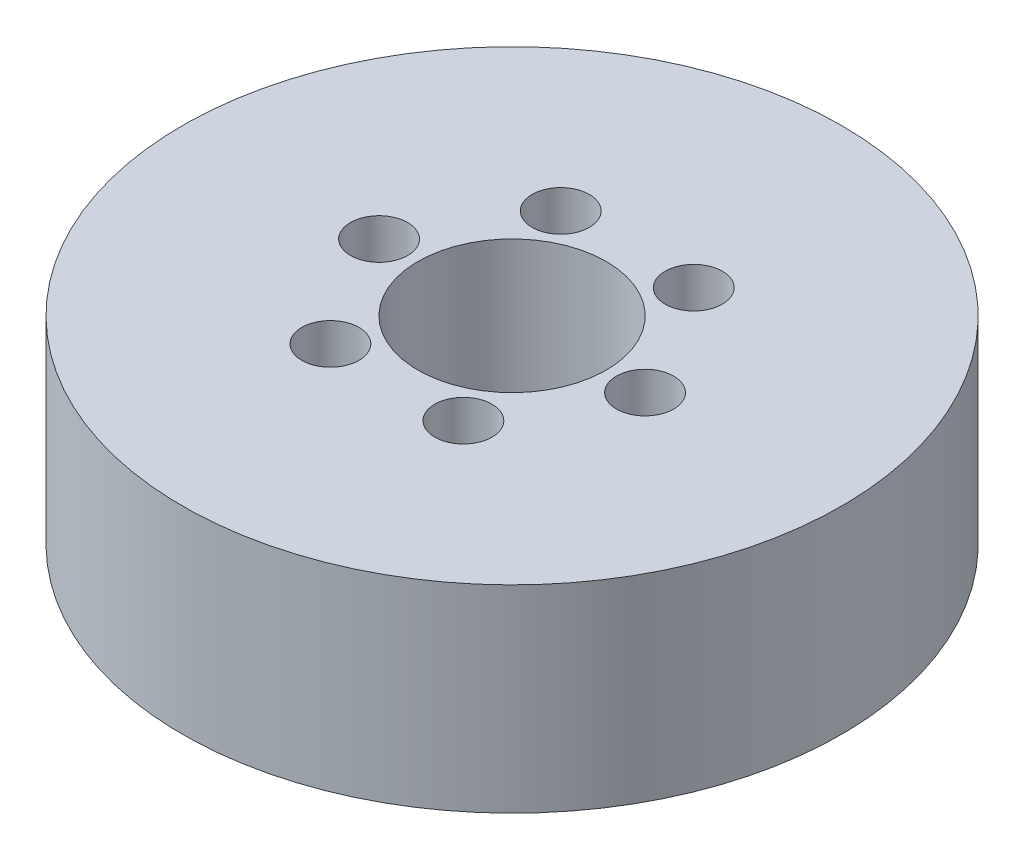
ISO-10303-21;
HEADER;
FILE_DESCRIPTION(('STEP AP214'),'2;1');
FILE_NAME('part.step','',(''),(''),'','','');
FILE_SCHEMA(('AUTOMOTIVE_DESIGN { 1 0 10303 214 1 1 1 1 }'));
ENDSEC;
DATA;
#1=APPLICATION_CONTEXT('core data for automotive mechanical design processes');
#2=APPLICATION_PROTOCOL_DEFINITION('international standard','automotive_design',2000,#1);
#3=PRODUCT_CONTEXT('',#1,'mechanical');
#4=PRODUCT('Part','Part','',(#3));
#5=PRODUCT_RELATED_PRODUCT_CATEGORY('part','',(#4));
#6=PRODUCT_DEFINITION_FORMATION('','',#4);
#7=PRODUCT_DEFINITION_CONTEXT('part definition',#1,'design');
#8=PRODUCT_DEFINITION('design','',#6,#7);
#9=PRODUCT_DEFINITION_SHAPE('','',#8);
#10=(LENGTH_UNIT() NAMED_UNIT(*) SI_UNIT(.MILLI.,.METRE.));
#11=(NAMED_UNIT(*) PLANE_ANGLE_UNIT() SI_UNIT($,.RADIAN.));
#12=(NAMED_UNIT(*) SI_UNIT($,.STERADIAN.) SOLID_ANGLE_UNIT());
#13=UNCERTAINTY_MEASURE_WITH_UNIT(LENGTH_MEASURE(1.E-05),#10,'distance_accuracy_value','');
#14=(GEOMETRIC_REPRESENTATION_CONTEXT(3) GLOBAL_UNCERTAINTY_ASSIGNED_CONTEXT((#13)) GLOBAL_UNIT_ASSIGNED_CONTEXT((#10,
#11,#12)) REPRESENTATION_CONTEXT('',''));
#15=CARTESIAN_POINT('',(0.,0.,0.));
#16=DIRECTION('',(0.,0.,1.));
#17=DIRECTION('',(1.,0.,0.));
#18=AXIS2_PLACEMENT_3D('',#15,#16,#17);
#19=CARTESIAN_POINT('',(0.,21.,0.));
#20=DIRECTION('',(0.,-1.,0.));
#21=DIRECTION('',(0.,0.,-1.));
#22=AXIS2_PLACEMENT_3D('',#19,#20,#21);
#23=CYLINDRICAL_SURFACE('',#22,35.);
#24=CARTESIAN_POINT('',(0.,21.,0.));
#25=DIRECTION('',(0.,1.,0.));
#26=DIRECTION('',(0.,0.,1.));
#27=AXIS2_PLACEMENT_3D('',#24,#25,#26);
#28=CIRCLE('',#27,35.);
#29=CARTESIAN_POINT('',(0.,21.,-35.));
#30=VERTEX_POINT('',#29);
#31=EDGE_CURVE('E10',#30,#30,#28,.T.);
#32=CARTESIAN_POINT('',(0.,0.,0.));
#33=DIRECTION('',(0.,1.,0.));
#34=DIRECTION('',(0.,0.,1.));
#35=AXIS2_PLACEMENT_3D('',#32,#33,#34);
#36=CIRCLE('',#35,35.);
#37=CARTESIAN_POINT('',(0.,0.,-35.));
#38=VERTEX_POINT('',#37);
#39=EDGE_CURVE('E37',#38,#38,#36,.T.);
#40=CARTESIAN_POINT('',(0.,21.,-35.));
#41=CARTESIAN_POINT('',(0.,20.78125,-35.));
#42=CARTESIAN_POINT('',(0.,20.5625,-35.));
#43=CARTESIAN_POINT('',(0.,20.125,-35.));
#44=CARTESIAN_POINT('',(0.,19.90625,-35.));
#45=CARTESIAN_POINT('',(0.,19.46875,-35.));
#46=CARTESIAN_POINT('',(0.,19.25,-35.));
#47=CARTESIAN_POINT('',(0.,18.8125,-35.));
#48=CARTESIAN_POINT('',(0.,18.59375,-35.));
#49=CARTESIAN_POINT('',(0.,18.15625,-35.));
#50=CARTESIAN_POINT('',(0.,17.9375,-35.));
#51=CARTESIAN_POINT('',(0.,17.5,-35.));
#52=CARTESIAN_POINT('',(0.,17.28125,-35.));
#53=CARTESIAN_POINT('',(0.,16.84375,-35.));
#54=CARTESIAN_POINT('',(0.,16.625,-35.));
#55=CARTESIAN_POINT('',(0.,16.1875,-35.));
#56=CARTESIAN_POINT('',(0.,15.96875,-35.));
#57=CARTESIAN_POINT('',(0.,15.53125,-35.));
#58=CARTESIAN_POINT('',(0.,15.3125,-35.));
#59=CARTESIAN_POINT('',(0.,14.875,-35.));
#60=CARTESIAN_POINT('',(0.,14.65625,-35.));
#61=CARTESIAN_POINT('',(0.,14.21875,-35.));
#62=CARTESIAN_POINT('',(0.,14.,-35.));
#63=CARTESIAN_POINT('',(0.,13.5625,-35.));
#64=CARTESIAN_POINT('',(0.,13.34375,-35.));
#65=CARTESIAN_POINT('',(0.,12.90625,-35.));
#66=CARTESIAN_POINT('',(0.,12.6875,-35.));
#67=CARTESIAN_POINT('',(0.,12.25,-35.));
#68=CARTESIAN_POINT('',(0.,12.03125,-35.));
#69=CARTESIAN_POINT('',(0.,11.59375,-35.));
#70=CARTESIAN_POINT('',(0.,11.375,-35.));
#71=CARTESIAN_POINT('',(0.,10.9375,-35.));
#72=CARTESIAN_POINT('',(0.,10.71875,-35.));
#73=CARTESIAN_POINT('',(0.,10.28125,-35.));
#74=CARTESIAN_POINT('',(0.,10.0625,-35.));
#75=CARTESIAN_POINT('',(0.,9.625,-35.));
#76=CARTESIAN_POINT('',(0.,9.40625,-35.));
#77=CARTESIAN_POINT('',(0.,8.96875,-35.));
#78=CARTESIAN_POINT('',(0.,8.75,-35.));
#79=CARTESIAN_POINT('',(0.,8.3125,-35.));
#80=CARTESIAN_POINT('',(0.,8.09375,-35.));
#81=CARTESIAN_POINT('',(0.,7.65625,-35.));
#82=CARTESIAN_POINT('',(0.,7.4375,-35.));
#83=CARTESIAN_POINT('',(0.,7.,-35.));
#84=CARTESIAN_POINT('',(0.,6.78125,-35.));
#85=CARTESIAN_POINT('',(0.,6.34375,-35.));
#86=CARTESIAN_POINT('',(0.,6.125,-35.));
#87=CARTESIAN_POINT('',(0.,5.6875,-35.));
#88=CARTESIAN_POINT('',(0.,5.46875,-35.));
#89=CARTESIAN_POINT('',(0.,5.03125,-35.));
#90=CARTESIAN_POINT('',(0.,4.8125,-35.));
#91=CARTESIAN_POINT('',(0.,4.375,-35.));
#92=CARTESIAN_POINT('',(0.,4.15625,-35.));
#93=CARTESIAN_POINT('',(0.,3.71875,-35.));
#94=CARTESIAN_POINT('',(0.,3.5,-35.));
#95=CARTESIAN_POINT('',(0.,3.0625,-35.));
#96=CARTESIAN_POINT('',(0.,2.84375,-35.));
#97=CARTESIAN_POINT('',(0.,2.40625,-35.));
#98=CARTESIAN_POINT('',(0.,2.1875,-35.));
#99=CARTESIAN_POINT('',(0.,1.75,-35.));
#100=CARTESIAN_POINT('',(0.,1.53125,-35.));
#101=CARTESIAN_POINT('',(0.,1.09375,-35.));
#102=CARTESIAN_POINT('',(0.,0.875000000000001,-35.));
#103=CARTESIAN_POINT('',(0.,0.4375,-35.));
#104=CARTESIAN_POINT('',(0.,0.21875,-35.));
#105=CARTESIAN_POINT('',(0.,0.,-35.));
#106=B_SPLINE_CURVE_WITH_KNOTS('',3,(#40,#41,#42,#43,#44,#45,#46,#47,#48,#49,#50,#51,#52,#53,
#54,#55,#56,#57,#58,#59,#60,#61,#62,#63,#64,#65,#66,#67,#68,#69,#70,#71,#72,#73,#74,#75,#76,#77,
#78,#79,#80,#81,#82,#83,#84,#85,#86,#87,#88,#89,#90,#91,#92,#93,#94,#95,#96,#97,#98,#99,#100,
#101,#102,#103,#104,#105),.UNSPECIFIED.,.F.,.F.,(4,2,2,2,2,2,2,2,2,2,2,2,2,2,2,2,2,2,2,2,2,2,2,
2,2,2,2,2,2,2,2,2,4),(0.,0.656250000000001,1.3125,1.96875,2.625,3.28125,3.9375,4.59375,5.25,
5.90625,6.5625,7.21875,7.875,8.53125,9.1875,9.84375,10.5,11.15625,11.8125,12.46875,13.125,
13.78125,14.4375,15.09375,15.75,16.40625,17.0625,17.71875,18.375,19.03125,19.6875,20.34375,21.),.UNSPECIFIED.);
#107=EDGE_CURVE('BSEAM40',#30,#38,#106,.T.);
#108=ORIENTED_EDGE('',*,*,#31,.F.);
#109=ORIENTED_EDGE('',*,*,#39,.T.);
#110=ORIENTED_EDGE('',*,*,#107,.T.);
#111=ORIENTED_EDGE('',*,*,#107,.F.);
#112=EDGE_LOOP('',(#108,#110,#109,#111));
#113=FACE_BOUND('',#112,.T.);
#114=ADVANCED_FACE('F40',(#113),#23,.T.);
#115=CARTESIAN_POINT('',(0.,21.,0.));
#116=DIRECTION('',(0.,1.,0.));
#117=DIRECTION('',(0.,0.,1.));
#118=AXIS2_PLACEMENT_3D('',#115,#116,#117);
#119=PLANE('',#118);
#120=CARTESIAN_POINT('',(-7.06172539715002,21.,-12.231267176963));
#121=DIRECTION('',(0.,1.,0.));
#122=DIRECTION('',(-0.866025403784433,0.,0.50000000000001));
#123=AXIS2_PLACEMENT_3D('',#120,#121,#122);
#124=CIRCLE('',#123,3.03759817467796);
#125=CARTESIAN_POINT('',(-9.69236258291036,21.,-10.712468089624));
#126=VERTEX_POINT('',#125);
#127=EDGE_CURVE('E70',#126,#126,#124,.T.);
#128=ORIENTED_EDGE('',*,*,#127,.F.);
#129=EDGE_LOOP('',(#128));
#130=FACE_BOUND('',#129,.T.);
#131=CARTESIAN_POINT('',(7.06172539714977,21.,-12.2312671769632));
#132=DIRECTION('',(0.,1.,0.));
#133=DIRECTION('',(-0.866025403784443,0.,-0.499999999999992));
#134=AXIS2_PLACEMENT_3D('',#131,#132,#133);
#135=CIRCLE('',#134,3.03759817467796);
#136=CARTESIAN_POINT('',(4.4310882113894,21.,-13.7500662643021));
#137=VERTEX_POINT('',#136);
#138=EDGE_CURVE('E71',#137,#137,#135,.T.);
#139=ORIENTED_EDGE('',*,*,#138,.F.);
#140=EDGE_LOOP('',(#139));
#141=FACE_BOUND('',#140,.T.);
#142=CARTESIAN_POINT('',(14.1234507942998,21.,0.));
#143=DIRECTION('',(0.,1.,0.));
#144=DIRECTION('',(0.,0.,-1.));
#145=AXIS2_PLACEMENT_3D('',#142,#143,#144);
#146=CIRCLE('',#145,3.03759817467796);
#147=CARTESIAN_POINT('',(14.1234507942998,21.,-3.03759817467796));
#148=VERTEX_POINT('',#147);
#149=EDGE_CURVE('E78',#148,#148,#146,.T.);
#150=ORIENTED_EDGE('',*,*,#149,.F.);
#151=EDGE_LOOP('',(#150));
#152=FACE_BOUND('',#151,.T.);
#153=CARTESIAN_POINT('',(7.06172539714994,21.,12.2312671769631));
#154=DIRECTION('',(0.,1.,0.));
#155=DIRECTION('',(0.866025403784436,0.,-0.500000000000004));
#156=AXIS2_PLACEMENT_3D('',#153,#154,#155);
#157=CIRCLE('',#156,3.03759817467796);
#158=CARTESIAN_POINT('',(9.69236258291028,21.,10.7124680896241));
#159=VERTEX_POINT('',#158);
#160=EDGE_CURVE('E84',#159,#159,#157,.T.);
#161=ORIENTED_EDGE('',*,*,#160,.F.);
#162=EDGE_LOOP('',(#161));
#163=FACE_BOUND('',#162,.T.);
#164=CARTESIAN_POINT('',(-7.06172539714985,21.,12.2312671769631));
#165=DIRECTION('',(0.,1.,0.));
#166=DIRECTION('',(0.86602540378444,0.,0.499999999999998));
#167=AXIS2_PLACEMENT_3D('',#164,#165,#166);
#168=CIRCLE('',#167,3.03759817467796);
#169=CARTESIAN_POINT('',(-4.43108821138949,21.,13.7500662643021));
#170=VERTEX_POINT('',#169);
#171=EDGE_CURVE('E61',#170,#170,#168,.T.);
#172=ORIENTED_EDGE('',*,*,#171,.F.);
#173=EDGE_LOOP('',(#172));
#174=FACE_BOUND('',#173,.T.);
#175=CARTESIAN_POINT('',(-14.1234507942998,21.,0.));
#176=DIRECTION('',(0.,1.,0.));
#177=DIRECTION('',(0.,0.,1.));
#178=AXIS2_PLACEMENT_3D('',#175,#176,#177);
#179=CIRCLE('',#178,3.03759817467796);
#180=CARTESIAN_POINT('',(-14.1234507942998,21.,3.03759817467796));
#181=VERTEX_POINT('',#180);
#182=EDGE_CURVE('E54',#181,#181,#179,.T.);
#183=ORIENTED_EDGE('',*,*,#182,.F.);
#184=EDGE_LOOP('',(#183));
#185=FACE_BOUND('',#184,.T.);
#186=CARTESIAN_POINT('',(0.,21.,0.));
#187=DIRECTION('',(0.,1.,0.));
#188=DIRECTION('',(0.,0.,1.));
#189=AXIS2_PLACEMENT_3D('',#186,#187,#188);
#190=CIRCLE('',#189,10.);
#191=CARTESIAN_POINT('',(0.,21.,-10.));
#192=VERTEX_POINT('',#191);
#193=EDGE_CURVE('E50',#192,#192,#190,.T.);
#194=ORIENTED_EDGE('',*,*,#193,.F.);
#195=EDGE_LOOP('',(#194));
#196=FACE_BOUND('',#195,.T.);
#197=ORIENTED_EDGE('',*,*,#31,.T.);
#198=EDGE_LOOP('',(#197));
#199=FACE_BOUND('',#198,.T.);
#200=ADVANCED_FACE('F99',(#130,#141,#152,#163,#174,#185,#196,#199),#119,.T.);
#201=CARTESIAN_POINT('',(0.,0.,0.));
#202=DIRECTION('',(0.,1.,0.));
#203=DIRECTION('',(0.,0.,1.));
#204=AXIS2_PLACEMENT_3D('',#201,#202,#203);
#205=PLANE('',#204);
#206=CARTESIAN_POINT('',(0.,0.,0.));
#207=DIRECTION('',(0.,1.,0.));
#208=DIRECTION('',(0.,0.,1.));
#209=AXIS2_PLACEMENT_3D('',#206,#207,#208);
#210=CIRCLE('',#209,10.);
#211=CARTESIAN_POINT('',(0.,0.,-10.));
#212=VERTEX_POINT('',#211);
#213=EDGE_CURVE('E47',#212,#212,#210,.T.);
#214=ORIENTED_EDGE('',*,*,#213,.T.);
#215=EDGE_LOOP('',(#214));
#216=FACE_BOUND('',#215,.T.);
#217=ORIENTED_EDGE('',*,*,#39,.F.);
#218=EDGE_LOOP('',(#217));
#219=FACE_BOUND('',#218,.T.);
#220=ADVANCED_FACE('F103',(#216,#219),#205,.F.);
#221=CARTESIAN_POINT('',(0.,21.,0.));
#222=DIRECTION('',(0.,-1.,0.));
#223=DIRECTION('',(0.,0.,-1.));
#224=AXIS2_PLACEMENT_3D('',#221,#222,#223);
#225=CYLINDRICAL_SURFACE('',#224,10.);
#226=CARTESIAN_POINT('',(0.,21.,-10.));
#227=CARTESIAN_POINT('',(0.,20.78125,-10.));
#228=CARTESIAN_POINT('',(0.,20.5625,-10.));
#229=CARTESIAN_POINT('',(0.,20.125,-10.));
#230=CARTESIAN_POINT('',(0.,19.90625,-10.));
#231=CARTESIAN_POINT('',(0.,19.46875,-10.));
#232=CARTESIAN_POINT('',(0.,19.25,-10.));
#233=CARTESIAN_POINT('',(0.,18.8125,-10.));
#234=CARTESIAN_POINT('',(0.,18.59375,-10.));
#235=CARTESIAN_POINT('',(0.,18.15625,-10.));
#236=CARTESIAN_POINT('',(0.,17.9375,-10.));
#237=CARTESIAN_POINT('',(0.,17.5,-10.));
#238=CARTESIAN_POINT('',(0.,17.28125,-10.));
#239=CARTESIAN_POINT('',(0.,16.84375,-10.));
#240=CARTESIAN_POINT('',(0.,16.625,-10.));
#241=CARTESIAN_POINT('',(0.,16.1875,-10.));
#242=CARTESIAN_POINT('',(0.,15.96875,-10.));
#243=CARTESIAN_POINT('',(0.,15.53125,-10.));
#244=CARTESIAN_POINT('',(0.,15.3125,-10.));
#245=CARTESIAN_POINT('',(0.,14.875,-10.));
#246=CARTESIAN_POINT('',(0.,14.65625,-10.));
#247=CARTESIAN_POINT('',(0.,14.21875,-10.));
#248=CARTESIAN_POINT('',(0.,14.,-10.));
#249=CARTESIAN_POINT('',(0.,13.5625,-10.));
#250=CARTESIAN_POINT('',(0.,13.34375,-10.));
#251=CARTESIAN_POINT('',(0.,12.90625,-10.));
#252=CARTESIAN_POINT('',(0.,12.6875,-10.));
#253=CARTESIAN_POINT('',(0.,12.25,-10.));
#254=CARTESIAN_POINT('',(0.,12.03125,-10.));
#255=CARTESIAN_POINT('',(0.,11.59375,-10.));
#256=CARTESIAN_POINT('',(0.,11.375,-10.));
#257=CARTESIAN_POINT('',(0.,10.9375,-10.));
#258=CARTESIAN_POINT('',(0.,10.71875,-10.));
#259=CARTESIAN_POINT('',(0.,10.28125,-10.));
#260=CARTESIAN_POINT('',(0.,10.0625,-10.));
#261=CARTESIAN_POINT('',(0.,9.625,-10.));
#262=CARTESIAN_POINT('',(0.,9.40625,-10.));
#263=CARTESIAN_POINT('',(0.,8.96875,-10.));
#264=CARTESIAN_POINT('',(0.,8.75,-10.));
#265=CARTESIAN_POINT('',(0.,8.3125,-10.));
#266=CARTESIAN_POINT('',(0.,8.09375,-10.));
#267=CARTESIAN_POINT('',(0.,7.65625,-10.));
#268=CARTESIAN_POINT('',(0.,7.4375,-10.));
#269=CARTESIAN_POINT('',(0.,7.,-10.));
#270=CARTESIAN_POINT('',(0.,6.78125,-10.));
#271=CARTESIAN_POINT('',(0.,6.34375,-10.));
#272=CARTESIAN_POINT('',(0.,6.125,-10.));
#273=CARTESIAN_POINT('',(0.,5.6875,-10.));
#274=CARTESIAN_POINT('',(0.,5.46875,-10.));
#275=CARTESIAN_POINT('',(0.,5.03125,-10.));
#276=CARTESIAN_POINT('',(0.,4.8125,-10.));
#277=CARTESIAN_POINT('',(0.,4.375,-10.));
#278=CARTESIAN_POINT('',(0.,4.15625,-10.));
#279=CARTESIAN_POINT('',(0.,3.71875,-10.));
#280=CARTESIAN_POINT('',(0.,3.5,-10.));
#281=CARTESIAN_POINT('',(0.,3.0625,-10.));
#282=CARTESIAN_POINT('',(0.,2.84375,-10.));
#283=CARTESIAN_POINT('',(0.,2.40625,-10.));
#284=CARTESIAN_POINT('',(0.,2.1875,-10.));
#285=CARTESIAN_POINT('',(0.,1.75,-10.));
#286=CARTESIAN_POINT('',(0.,1.53125,-10.));
#287=CARTESIAN_POINT('',(0.,1.09375,-10.));
#288=CARTESIAN_POINT('',(0.,0.875000000000001,-10.));
#289=CARTESIAN_POINT('',(0.,0.4375,-10.));
#290=CARTESIAN_POINT('',(0.,0.21875,-10.));
#291=CARTESIAN_POINT('',(0.,0.,-10.));
#292=B_SPLINE_CURVE_WITH_KNOTS('',3,(#226,#227,#228,#229,#230,#231,#232,#233,#234,#235,#236,
#237,#238,#239,#240,#241,#242,#243,#244,#245,#246,#247,#248,#249,#250,#251,#252,#253,#254,#255,
#256,#257,#258,#259,#260,#261,#262,#263,#264,#265,#266,#267,#268,#269,#270,#271,#272,#273,#274,
#275,#276,#277,#278,#279,#280,#281,#282,#283,#284,#285,#286,#287,#288,#289,#290,#291),
.UNSPECIFIED.,.F.,.F.,(4,2,2,2,2,2,2,2,2,2,2,2,2,2,2,2,2,2,2,2,2,2,2,2,2,2,2,2,2,2,2,2,4),(0.,
0.656249999999997,1.3125,1.96875,2.625,3.28125,3.9375,4.59375,5.25,5.90625,6.5625,7.21875,7.875,
8.53125,9.1875,9.84375,10.5,11.15625,11.8125,12.46875,13.125,13.78125,14.4375,15.09375,15.75,
16.40625,17.0625,17.71875,18.375,19.03125,19.6875,20.34375,21.),.UNSPECIFIED.);
#293=EDGE_CURVE('BSEAM115',#192,#212,#292,.T.);
#294=ORIENTED_EDGE('',*,*,#193,.T.);
#295=ORIENTED_EDGE('',*,*,#213,.F.);
#296=ORIENTED_EDGE('',*,*,#293,.T.);
#297=ORIENTED_EDGE('',*,*,#293,.F.);
#298=EDGE_LOOP('',(#294,#296,#295,#297));
#299=FACE_BOUND('',#298,.T.);
#300=ADVANCED_FACE('F115',(#299),#225,.F.);
#301=CARTESIAN_POINT('',(-14.1234507942998,2.18816775241988,0.));
#302=DIRECTION('',(0.,1.,0.));
#303=DIRECTION('',(0.,0.,1.));
#304=AXIS2_PLACEMENT_3D('',#301,#302,#303);
#305=CYLINDRICAL_SURFACE('',#304,3.03759817467796);
#306=CARTESIAN_POINT('',(-14.1234507942998,2.18816775241988,0.));
#307=DIRECTION('',(0.,1.,0.));
#308=DIRECTION('',(0.,0.,1.));
#309=AXIS2_PLACEMENT_3D('',#306,#307,#308);
#310=CIRCLE('',#309,3.03759817467796);
#311=CARTESIAN_POINT('',(-14.1234507942998,2.18816775241988,3.03759817467796));
#312=VERTEX_POINT('',#311);
#313=EDGE_CURVE('E55',#312,#312,#310,.T.);
#314=ORIENTED_EDGE('',*,*,#313,.F.);
#315=EDGE_LOOP('',(#314));
#316=FACE_BOUND('',#315,.T.);
#317=ORIENTED_EDGE('',*,*,#182,.T.);
#318=EDGE_LOOP('',(#317));
#319=FACE_BOUND('',#318,.T.);
#320=ADVANCED_FACE('F113',(#316,#319),#305,.F.);
#321=CARTESIAN_POINT('',(-14.1234507942998,2.18816775241988,0.));
#322=DIRECTION('',(0.,1.,0.));
#323=DIRECTION('',(0.,0.,1.));
#324=AXIS2_PLACEMENT_3D('',#321,#322,#323);
#325=PLANE('',#324);
#326=ORIENTED_EDGE('',*,*,#313,.T.);
#327=EDGE_LOOP('',(#326));
#328=FACE_BOUND('',#327,.T.);
#329=ADVANCED_FACE('F144',(#328),#325,.T.);
#330=CARTESIAN_POINT('',(-7.06172539714985,2.18816775241988,12.2312671769631));
#331=DIRECTION('',(0.,1.,0.));
#332=DIRECTION('',(0.,0.,1.));
#333=AXIS2_PLACEMENT_3D('',#330,#331,#332);
#334=CYLINDRICAL_SURFACE('',#333,3.03759817467796);
#335=CARTESIAN_POINT('',(-7.06172539714985,2.18816775241988,12.2312671769631));
#336=DIRECTION('',(0.,1.,0.));
#337=DIRECTION('',(0.86602540378444,0.,0.499999999999998));
#338=AXIS2_PLACEMENT_3D('',#335,#336,#337);
#339=CIRCLE('',#338,3.03759817467796);
#340=CARTESIAN_POINT('',(-4.43108821138949,2.18816775241988,13.7500662643021));
#341=VERTEX_POINT('',#340);
#342=EDGE_CURVE('E59',#341,#341,#339,.T.);
#343=ORIENTED_EDGE('',*,*,#342,.F.);
#344=EDGE_LOOP('',(#343));
#345=FACE_BOUND('',#344,.T.);
#346=ORIENTED_EDGE('',*,*,#171,.T.);
#347=EDGE_LOOP('',(#346));
#348=FACE_BOUND('',#347,.T.);
#349=ADVANCED_FACE('F153',(#345,#348),#334,.F.);
#350=CARTESIAN_POINT('',(-7.06172539714985,2.18816775241988,12.2312671769631));
#351=DIRECTION('',(0.,1.,0.));
#352=DIRECTION('',(0.86602540378444,0.,0.499999999999998));
#353=AXIS2_PLACEMENT_3D('',#350,#351,#352);
#354=PLANE('',#353);
#355=ORIENTED_EDGE('',*,*,#342,.T.);
#356=EDGE_LOOP('',(#355));
#357=FACE_BOUND('',#356,.T.);
#358=ADVANCED_FACE('F96',(#357),#354,.T.);
#359=CARTESIAN_POINT('',(7.06172539714994,2.18816775241988,12.2312671769631));
#360=DIRECTION('',(0.,1.,0.));
#361=DIRECTION('',(0.,0.,1.));
#362=AXIS2_PLACEMENT_3D('',#359,#360,#361);
#363=CYLINDRICAL_SURFACE('',#362,3.03759817467796);
#364=CARTESIAN_POINT('',(7.06172539714994,2.18816775241988,12.2312671769631));
#365=DIRECTION('',(0.,1.,0.));
#366=DIRECTION('',(0.866025403784436,0.,-0.500000000000004));
#367=AXIS2_PLACEMENT_3D('',#364,#365,#366);
#368=CIRCLE('',#367,3.03759817467796);
#369=CARTESIAN_POINT('',(9.69236258291028,2.18816775241988,10.7124680896241));
#370=VERTEX_POINT('',#369);
#371=EDGE_CURVE('E63',#370,#370,#368,.T.);
#372=ORIENTED_EDGE('',*,*,#371,.F.);
#373=EDGE_LOOP('',(#372));
#374=FACE_BOUND('',#373,.T.);
#375=ORIENTED_EDGE('',*,*,#160,.T.);
#376=EDGE_LOOP('',(#375));
#377=FACE_BOUND('',#376,.T.);
#378=ADVANCED_FACE('F91',(#374,#377),#363,.F.);
#379=CARTESIAN_POINT('',(7.06172539714994,2.18816775241988,12.2312671769631));
#380=DIRECTION('',(0.,1.,0.));
#381=DIRECTION('',(0.866025403784436,0.,-0.500000000000004));
#382=AXIS2_PLACEMENT_3D('',#379,#380,#381);
#383=PLANE('',#382);
#384=ORIENTED_EDGE('',*,*,#371,.T.);
#385=EDGE_LOOP('',(#384));
#386=FACE_BOUND('',#385,.T.);
#387=ADVANCED_FACE('F93',(#386),#383,.T.);
#388=CARTESIAN_POINT('',(14.1234507942998,2.18816775241988,0.));
#389=DIRECTION('',(0.,1.,0.));
#390=DIRECTION('',(0.,0.,1.));
#391=AXIS2_PLACEMENT_3D('',#388,#389,#390);
#392=CYLINDRICAL_SURFACE('',#391,3.03759817467796);
#393=CARTESIAN_POINT('',(14.1234507942998,2.18816775241988,0.));
#394=DIRECTION('',(0.,1.,0.));
#395=DIRECTION('',(0.,0.,-1.));
#396=AXIS2_PLACEMENT_3D('',#393,#394,#395);
#397=CIRCLE('',#396,3.03759817467796);
#398=CARTESIAN_POINT('',(14.1234507942998,2.18816775241988,-3.03759817467796));
#399=VERTEX_POINT('',#398);
#400=EDGE_CURVE('E85',#399,#399,#397,.T.);
#401=ORIENTED_EDGE('',*,*,#400,.F.);
#402=EDGE_LOOP('',(#401));
#403=FACE_BOUND('',#402,.T.);
#404=ORIENTED_EDGE('',*,*,#149,.T.);
#405=EDGE_LOOP('',(#404));
#406=FACE_BOUND('',#405,.T.);
#407=ADVANCED_FACE('F187',(#403,#406),#392,.F.);
#408=CARTESIAN_POINT('',(14.1234507942998,2.18816775241988,0.));
#409=DIRECTION('',(0.,1.,0.));
#410=DIRECTION('',(0.,0.,-1.));
#411=AXIS2_PLACEMENT_3D('',#408,#409,#410);
#412=PLANE('',#411);
#413=ORIENTED_EDGE('',*,*,#400,.T.);
#414=EDGE_LOOP('',(#413));
#415=FACE_BOUND('',#414,.T.);
#416=ADVANCED_FACE('F198',(#415),#412,.T.);
#417=CARTESIAN_POINT('',(7.06172539714977,2.18816775241988,-12.2312671769632));
#418=DIRECTION('',(0.,1.,0.));
#419=DIRECTION('',(0.,0.,1.));
#420=AXIS2_PLACEMENT_3D('',#417,#418,#419);
#421=CYLINDRICAL_SURFACE('',#420,3.03759817467796);
#422=CARTESIAN_POINT('',(7.06172539714977,2.18816775241988,-12.2312671769632));
#423=DIRECTION('',(0.,1.,0.));
#424=DIRECTION('',(-0.866025403784443,0.,-0.499999999999992));
#425=AXIS2_PLACEMENT_3D('',#422,#423,#424);
#426=CIRCLE('',#425,3.03759817467796);
#427=CARTESIAN_POINT('',(4.4310882113894,2.18816775241988,-13.7500662643021));
#428=VERTEX_POINT('',#427);
#429=EDGE_CURVE('E76',#428,#428,#426,.T.);
#430=ORIENTED_EDGE('',*,*,#429,.F.);
#431=EDGE_LOOP('',(#430));
#432=FACE_BOUND('',#431,.T.);
#433=ORIENTED_EDGE('',*,*,#138,.T.);
#434=EDGE_LOOP('',(#433));
#435=FACE_BOUND('',#434,.T.);
#436=ADVANCED_FACE('F202',(#432,#435),#421,.F.);
#437=CARTESIAN_POINT('',(7.06172539714977,2.18816775241988,-12.2312671769632));
#438=DIRECTION('',(0.,1.,0.));
#439=DIRECTION('',(-0.866025403784443,0.,-0.499999999999992));
#440=AXIS2_PLACEMENT_3D('',#437,#438,#439);
#441=PLANE('',#440);
#442=ORIENTED_EDGE('',*,*,#429,.T.);
#443=EDGE_LOOP('',(#442));
#444=FACE_BOUND('',#443,.T.);
#445=ADVANCED_FACE('F212',(#444),#441,.T.);
#446=CARTESIAN_POINT('',(-7.06172539715002,2.18816775241988,-12.231267176963));
#447=DIRECTION('',(0.,1.,0.));
#448=DIRECTION('',(0.,0.,1.));
#449=AXIS2_PLACEMENT_3D('',#446,#447,#448);
#450=CYLINDRICAL_SURFACE('',#449,3.03759817467796);
#451=CARTESIAN_POINT('',(-7.06172539715002,2.18816775241988,-12.231267176963));
#452=DIRECTION('',(0.,1.,0.));
#453=DIRECTION('',(-0.866025403784433,0.,0.50000000000001));
#454=AXIS2_PLACEMENT_3D('',#451,#452,#453);
#455=CIRCLE('',#454,3.03759817467796);
#456=CARTESIAN_POINT('',(-9.69236258291036,2.18816775241988,-10.712468089624));
#457=VERTEX_POINT('',#456);
#458=EDGE_CURVE('E69',#457,#457,#455,.T.);
#459=ORIENTED_EDGE('',*,*,#458,.F.);
#460=EDGE_LOOP('',(#459));
#461=FACE_BOUND('',#460,.T.);
#462=ORIENTED_EDGE('',*,*,#127,.T.);
#463=EDGE_LOOP('',(#462));
#464=FACE_BOUND('',#463,.T.);
#465=ADVANCED_FACE('F224',(#461,#464),#450,.F.);
#466=CARTESIAN_POINT('',(-7.06172539715002,2.18816775241988,-12.231267176963));
#467=DIRECTION('',(0.,1.,0.));
#468=DIRECTION('',(-0.866025403784433,0.,0.50000000000001));
#469=AXIS2_PLACEMENT_3D('',#466,#467,#468);
#470=PLANE('',#469);
#471=ORIENTED_EDGE('',*,*,#458,.T.);
#472=EDGE_LOOP('',(#471));
#473=FACE_BOUND('',#472,.T.);
#474=ADVANCED_FACE('F235',(#473),#470,.T.);
#475=CLOSED_SHELL('',(#114,#200,#220,#300,#320,#329,#349,#358,#378,#387,#407,#416,#436,#445,
#465,#474));
#476=MANIFOLD_SOLID_BREP('B2',#475);
#477=ADVANCED_BREP_SHAPE_REPRESENTATION('',(#18,#476),#14);
#478=SHAPE_DEFINITION_REPRESENTATION(#9,#477);
ENDSEC;
END-ISO-10303-21;
